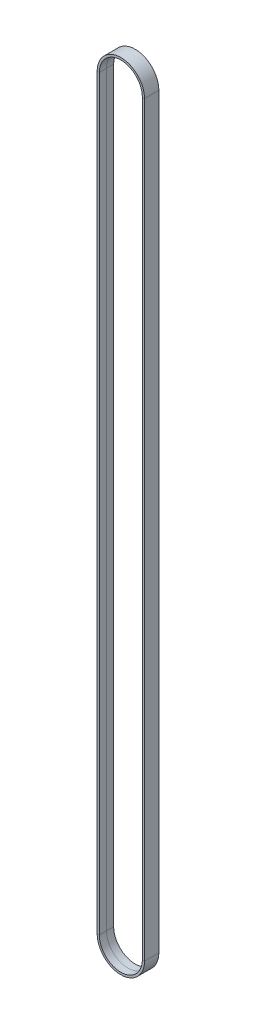
ISO-10303-21;
HEADER;
FILE_DESCRIPTION(('STEP AP214'),'2;1');
FILE_NAME('part.step','',(''),(''),'','','');
FILE_SCHEMA(('AUTOMOTIVE_DESIGN { 1 0 10303 214 1 1 1 1 }'));
ENDSEC;
DATA;
#1=APPLICATION_CONTEXT('core data for automotive mechanical design processes');
#2=APPLICATION_PROTOCOL_DEFINITION('international standard','automotive_design',2000,#1);
#3=PRODUCT_CONTEXT('',#1,'mechanical');
#4=PRODUCT('Part','Part','',(#3));
#5=PRODUCT_RELATED_PRODUCT_CATEGORY('part','',(#4));
#6=PRODUCT_DEFINITION_FORMATION('','',#4);
#7=PRODUCT_DEFINITION_CONTEXT('part definition',#1,'design');
#8=PRODUCT_DEFINITION('design','',#6,#7);
#9=PRODUCT_DEFINITION_SHAPE('','',#8);
#10=(LENGTH_UNIT() NAMED_UNIT(*) SI_UNIT(.MILLI.,.METRE.));
#11=(NAMED_UNIT(*) PLANE_ANGLE_UNIT() SI_UNIT($,.RADIAN.));
#12=(NAMED_UNIT(*) SI_UNIT($,.STERADIAN.) SOLID_ANGLE_UNIT());
#13=UNCERTAINTY_MEASURE_WITH_UNIT(LENGTH_MEASURE(1.E-05),#10,'distance_accuracy_value','');
#14=(GEOMETRIC_REPRESENTATION_CONTEXT(3) GLOBAL_UNCERTAINTY_ASSIGNED_CONTEXT((#13)) GLOBAL_UNIT_ASSIGNED_CONTEXT((#10,
#11,#12)) REPRESENTATION_CONTEXT('',''));
#15=CARTESIAN_POINT('',(0.,0.,0.));
#16=DIRECTION('',(0.,0.,1.));
#17=DIRECTION('',(1.,0.,0.));
#18=AXIS2_PLACEMENT_3D('',#15,#16,#17);
#19=CARTESIAN_POINT('',(-63.4535013190872,468.894202141089,4.5));
#20=DIRECTION('',(0.,0.,1.));
#21=DIRECTION('',(1.,0.,0.));
#22=AXIS2_PLACEMENT_3D('',#19,#20,#21);
#23=PLANE('',#22);
#24=DIRECTION('',(0.,-1.,0.));
#25=VECTOR('',#24,1.);
#26=CARTESIAN_POINT('',(-63.4535013190872,468.894202141089,4.5));
#27=LINE('',#26,#25);
#28=CARTESIAN_POINT('',(-63.4535013190872,468.89420214105,4.5));
#29=VERTEX_POINT('',#28);
#30=CARTESIAN_POINT('',(-63.4535013190872,1.1109907647129E-09,4.5));
#31=VERTEX_POINT('',#30);
#32=EDGE_CURVE('E11',#29,#31,#27,.T.);
#33=ORIENTED_EDGE('',*,*,#32,.F.);
#34=DIRECTION('',(-1.,0.,0.));
#35=VECTOR('',#34,1.);
#36=CARTESIAN_POINT('',(-63.4535013190872,468.89420214105,4.5));
#37=LINE('',#36,#35);
#38=CARTESIAN_POINT('',(-64.8135013190872,468.89420214105,4.5));
#39=VERTEX_POINT('',#38);
#40=EDGE_CURVE('E39',#29,#39,#37,.T.);
#41=ORIENTED_EDGE('',*,*,#40,.T.);
#42=DIRECTION('',(0.,-1.,0.));
#43=VECTOR('',#42,1.);
#44=CARTESIAN_POINT('',(-64.8135013190872,468.894202141089,4.5));
#45=LINE('',#44,#43);
#46=CARTESIAN_POINT('',(-64.8135013190872,1.1109907647129E-09,4.5));
#47=VERTEX_POINT('',#46);
#48=EDGE_CURVE('E152',#39,#47,#45,.T.);
#49=ORIENTED_EDGE('',*,*,#48,.T.);
#50=DIRECTION('',(-1.,0.,0.));
#51=VECTOR('',#50,1.);
#52=CARTESIAN_POINT('',(-63.4535013190872,1.1109907647129E-09,4.5));
#53=LINE('',#52,#51);
#54=EDGE_CURVE('E155',#31,#47,#53,.T.);
#55=ORIENTED_EDGE('',*,*,#54,.F.);
#56=EDGE_LOOP('',(#33,#41,#49,#55));
#57=FACE_BOUND('',#56,.T.);
#58=ADVANCED_FACE('F36',(#57),#23,.T.);
#59=CARTESIAN_POINT('',(-63.4535013190872,468.894202141089,-4.5));
#60=DIRECTION('',(1.,0.,0.));
#61=DIRECTION('',(0.,0.,-1.));
#62=AXIS2_PLACEMENT_3D('',#59,#60,#61);
#63=PLANE('',#62);
#64=DIRECTION('',(0.,-1.,0.));
#65=VECTOR('',#64,1.);
#66=CARTESIAN_POINT('',(-63.4535013190872,468.894202141089,-4.5));
#67=LINE('',#66,#65);
#68=CARTESIAN_POINT('',(-63.4535013190872,468.89420214105,-4.5));
#69=VERTEX_POINT('',#68);
#70=CARTESIAN_POINT('',(-63.4535013190872,1.1109907647129E-09,-4.5));
#71=VERTEX_POINT('',#70);
#72=EDGE_CURVE('E44',#69,#71,#67,.T.);
#73=ORIENTED_EDGE('',*,*,#72,.F.);
#74=DIRECTION('',(0.,0.,1.));
#75=VECTOR('',#74,1.);
#76=CARTESIAN_POINT('',(-63.4535013190872,468.89420214105,-4.5));
#77=LINE('',#76,#75);
#78=EDGE_CURVE('E235',#69,#29,#77,.T.);
#79=ORIENTED_EDGE('',*,*,#78,.T.);
#80=ORIENTED_EDGE('',*,*,#32,.T.);
#81=DIRECTION('',(0.,0.,1.));
#82=VECTOR('',#81,1.);
#83=CARTESIAN_POINT('',(-63.4535013190872,1.1109907647129E-09,-4.5));
#84=LINE('',#83,#82);
#85=EDGE_CURVE('E176',#71,#31,#84,.T.);
#86=ORIENTED_EDGE('',*,*,#85,.F.);
#87=EDGE_LOOP('',(#73,#79,#80,#86));
#88=FACE_BOUND('',#87,.T.);
#89=ADVANCED_FACE('F259',(#88),#63,.T.);
#90=CARTESIAN_POINT('',(-64.8135013190872,468.894202141089,-4.5));
#91=DIRECTION('',(0.,0.,-1.));
#92=DIRECTION('',(-1.,0.,0.));
#93=AXIS2_PLACEMENT_3D('',#90,#91,#92);
#94=PLANE('',#93);
#95=DIRECTION('',(0.,-1.,0.));
#96=VECTOR('',#95,1.);
#97=CARTESIAN_POINT('',(-64.8135013190872,468.894202141089,-4.5));
#98=LINE('',#97,#96);
#99=CARTESIAN_POINT('',(-64.8135013190872,468.89420214105,-4.5));
#100=VERTEX_POINT('',#99);
#101=CARTESIAN_POINT('',(-64.8135013190872,1.1109907647129E-09,-4.5));
#102=VERTEX_POINT('',#101);
#103=EDGE_CURVE('E141',#100,#102,#98,.T.);
#104=ORIENTED_EDGE('',*,*,#103,.F.);
#105=DIRECTION('',(1.,0.,0.));
#106=VECTOR('',#105,1.);
#107=CARTESIAN_POINT('',(-64.8135013190872,468.89420214105,-4.5));
#108=LINE('',#107,#106);
#109=EDGE_CURVE('E220',#100,#69,#108,.T.);
#110=ORIENTED_EDGE('',*,*,#109,.T.);
#111=ORIENTED_EDGE('',*,*,#72,.T.);
#112=DIRECTION('',(1.,0.,0.));
#113=VECTOR('',#112,1.);
#114=CARTESIAN_POINT('',(-64.8135013190872,1.1109907647129E-09,-4.5));
#115=LINE('',#114,#113);
#116=EDGE_CURVE('E182',#102,#71,#115,.T.);
#117=ORIENTED_EDGE('',*,*,#116,.F.);
#118=EDGE_LOOP('',(#104,#110,#111,#117));
#119=FACE_BOUND('',#118,.T.);
#120=ADVANCED_FACE('F264',(#119),#94,.T.);
#121=CARTESIAN_POINT('',(-64.8135013190872,468.894202141089,0.));
#122=DIRECTION('',(-1.,0.,0.));
#123=DIRECTION('',(0.,0.,1.));
#124=AXIS2_PLACEMENT_3D('',#121,#122,#123);
#125=PLANE('',#124);
#126=DIRECTION('',(0.,-1.,0.));
#127=VECTOR('',#126,1.);
#128=CARTESIAN_POINT('',(-64.8135013190872,468.894202141089,0.));
#129=LINE('',#128,#127);
#130=CARTESIAN_POINT('',(-64.8135013190872,468.89420214105,0.));
#131=VERTEX_POINT('',#130);
#132=CARTESIAN_POINT('',(-64.8135013190872,1.1109907647129E-09,0.));
#133=VERTEX_POINT('',#132);
#134=EDGE_CURVE('E148',#131,#133,#129,.T.);
#135=ORIENTED_EDGE('',*,*,#134,.F.);
#136=DIRECTION('',(0.,0.,-1.));
#137=VECTOR('',#136,1.);
#138=CARTESIAN_POINT('',(-64.8135013190872,468.89420214105,0.));
#139=LINE('',#138,#137);
#140=EDGE_CURVE('E204',#131,#100,#139,.T.);
#141=ORIENTED_EDGE('',*,*,#140,.T.);
#142=ORIENTED_EDGE('',*,*,#103,.T.);
#143=DIRECTION('',(0.,0.,-1.));
#144=VECTOR('',#143,1.);
#145=CARTESIAN_POINT('',(-64.8135013190872,1.1109907647129E-09,0.));
#146=LINE('',#145,#144);
#147=EDGE_CURVE('E179',#133,#102,#146,.T.);
#148=ORIENTED_EDGE('',*,*,#147,.F.);
#149=EDGE_LOOP('',(#135,#141,#142,#148));
#150=FACE_BOUND('',#149,.T.);
#151=ADVANCED_FACE('F267',(#150),#125,.T.);
#152=CARTESIAN_POINT('',(-93.1735013190872,468.89420213925,4.5));
#153=DIRECTION('',(0.,0.,1.));
#154=DIRECTION('',(1.,0.,0.));
#155=AXIS2_PLACEMENT_3D('',#152,#153,#154);
#156=PLANE('',#155);
#157=ORIENTED_EDGE('',*,*,#40,.F.);
#158=CARTESIAN_POINT('',(-78.3135013190872,468.89420214015,4.5));
#159=DIRECTION('',(0.,0.,-1.));
#160=DIRECTION('',(-1.,-6.05616947349362E-11,0.));
#161=AXIS2_PLACEMENT_3D('',#158,#159,#160);
#162=CIRCLE('',#161,14.86);
#163=CARTESIAN_POINT('',(-93.1735013190872,468.894202139249,4.5));
#164=VERTEX_POINT('',#163);
#165=EDGE_CURVE('E81',#164,#29,#162,.T.);
#166=ORIENTED_EDGE('',*,*,#165,.F.);
#167=DIRECTION('',(1.,5.99397968617669E-13,0.));
#168=VECTOR('',#167,1.);
#169=CARTESIAN_POINT('',(-93.1735013190872,468.894202139249,4.5));
#170=LINE('',#169,#168);
#171=CARTESIAN_POINT('',(-91.8135013190872,468.89420213925,4.5));
#172=VERTEX_POINT('',#171);
#173=EDGE_CURVE('E207',#164,#172,#170,.T.);
#174=ORIENTED_EDGE('',*,*,#173,.T.);
#175=CARTESIAN_POINT('',(-78.3135013190872,468.89420214015,4.5));
#176=DIRECTION('',(0.,0.,-1.));
#177=DIRECTION('',(-1.,-6.66627247230483E-11,0.));
#178=AXIS2_PLACEMENT_3D('',#175,#176,#177);
#179=CIRCLE('',#178,13.5);
#180=EDGE_CURVE('E201',#172,#39,#179,.T.);
#181=ORIENTED_EDGE('',*,*,#180,.T.);
#182=EDGE_LOOP('',(#157,#166,#174,#181));
#183=FACE_BOUND('',#182,.T.);
#184=ADVANCED_FACE('F248',(#183),#156,.T.);
#185=CARTESIAN_POINT('',(-78.3135013190872,468.89420214015,0.));
#186=DIRECTION('',(0.,0.,-1.));
#187=DIRECTION('',(-1.,0.,0.));
#188=AXIS2_PLACEMENT_3D('',#185,#186,#187);
#189=CYLINDRICAL_SURFACE('',#188,14.86);
#190=ORIENTED_EDGE('',*,*,#165,.T.);
#191=ORIENTED_EDGE('',*,*,#78,.F.);
#192=CARTESIAN_POINT('',(-78.3135013190872,468.89420214015,-4.5));
#193=DIRECTION('',(0.,0.,-1.));
#194=DIRECTION('',(-1.,-6.05616947349362E-11,0.));
#195=AXIS2_PLACEMENT_3D('',#192,#193,#194);
#196=CIRCLE('',#195,14.86);
#197=CARTESIAN_POINT('',(-93.1735013190872,468.894202139249,-4.5));
#198=VERTEX_POINT('',#197);
#199=EDGE_CURVE('E90',#198,#69,#196,.T.);
#200=ORIENTED_EDGE('',*,*,#199,.F.);
#201=DIRECTION('',(0.,0.,1.));
#202=VECTOR('',#201,1.);
#203=CARTESIAN_POINT('',(-93.1735013190872,468.894202139249,-4.5));
#204=LINE('',#203,#202);
#205=EDGE_CURVE('E231',#198,#164,#204,.T.);
#206=ORIENTED_EDGE('',*,*,#205,.T.);
#207=EDGE_LOOP('',(#190,#191,#200,#206));
#208=FACE_BOUND('',#207,.T.);
#209=ADVANCED_FACE('F258',(#208),#189,.T.);
#210=CARTESIAN_POINT('',(-91.8135013190872,468.89420213925,-4.5));
#211=DIRECTION('',(0.,0.,-1.));
#212=DIRECTION('',(-1.,0.,0.));
#213=AXIS2_PLACEMENT_3D('',#210,#211,#212);
#214=PLANE('',#213);
#215=ORIENTED_EDGE('',*,*,#199,.T.);
#216=ORIENTED_EDGE('',*,*,#109,.F.);
#217=CARTESIAN_POINT('',(-78.3135013190872,468.89420214015,-4.5));
#218=DIRECTION('',(0.,0.,-1.));
#219=DIRECTION('',(-1.,-6.66627247230483E-11,0.));
#220=AXIS2_PLACEMENT_3D('',#217,#218,#219);
#221=CIRCLE('',#220,13.5);
#222=CARTESIAN_POINT('',(-91.8135013190872,468.89420213925,-4.5));
#223=VERTEX_POINT('',#222);
#224=EDGE_CURVE('E99',#223,#100,#221,.T.);
#225=ORIENTED_EDGE('',*,*,#224,.F.);
#226=DIRECTION('',(-1.,-5.99397968617669E-13,0.));
#227=VECTOR('',#226,1.);
#228=CARTESIAN_POINT('',(-91.8135013190872,468.89420213925,-4.5));
#229=LINE('',#228,#227);
#230=EDGE_CURVE('E217',#223,#198,#229,.T.);
#231=ORIENTED_EDGE('',*,*,#230,.T.);
#232=EDGE_LOOP('',(#215,#216,#225,#231));
#233=FACE_BOUND('',#232,.T.);
#234=ADVANCED_FACE('F279',(#233),#214,.T.);
#235=CARTESIAN_POINT('',(-78.3135013190872,468.89420214015,0.));
#236=DIRECTION('',(0.,0.,-1.));
#237=DIRECTION('',(-1.,0.,0.));
#238=AXIS2_PLACEMENT_3D('',#235,#236,#237);
#239=CYLINDRICAL_SURFACE('',#238,13.5);
#240=ORIENTED_EDGE('',*,*,#224,.T.);
#241=ORIENTED_EDGE('',*,*,#140,.F.);
#242=CARTESIAN_POINT('',(-78.3135013190872,468.89420214015,0.));
#243=DIRECTION('',(0.,0.,-1.));
#244=DIRECTION('',(-1.,-6.66627247230483E-11,0.));
#245=AXIS2_PLACEMENT_3D('',#242,#243,#244);
#246=CIRCLE('',#245,13.5);
#247=CARTESIAN_POINT('',(-91.8135013190872,468.89420213925,0.));
#248=VERTEX_POINT('',#247);
#249=EDGE_CURVE('E200',#248,#131,#246,.T.);
#250=ORIENTED_EDGE('',*,*,#249,.F.);
#251=DIRECTION('',(0.,0.,-1.));
#252=VECTOR('',#251,1.);
#253=CARTESIAN_POINT('',(-91.8135013190872,468.89420213925,0.));
#254=LINE('',#253,#252);
#255=EDGE_CURVE('E194',#248,#223,#254,.T.);
#256=ORIENTED_EDGE('',*,*,#255,.T.);
#257=EDGE_LOOP('',(#240,#241,#250,#256));
#258=FACE_BOUND('',#257,.T.);
#259=ADVANCED_FACE('F270',(#258),#239,.F.);
#260=CARTESIAN_POINT('',(-78.3135013190872,468.89420214015,0.));
#261=DIRECTION('',(0.,0.,-1.));
#262=DIRECTION('',(-1.,0.,0.));
#263=AXIS2_PLACEMENT_3D('',#260,#261,#262);
#264=CYLINDRICAL_SURFACE('',#263,13.5);
#265=ORIENTED_EDGE('',*,*,#249,.T.);
#266=DIRECTION('',(0.,0.,-1.));
#267=VECTOR('',#266,1.);
#268=CARTESIAN_POINT('',(-64.8135013190872,468.89420214105,4.5));
#269=LINE('',#268,#267);
#270=EDGE_CURVE('E198',#39,#131,#269,.T.);
#271=ORIENTED_EDGE('',*,*,#270,.F.);
#272=ORIENTED_EDGE('',*,*,#180,.F.);
#273=DIRECTION('',(0.,0.,-1.));
#274=VECTOR('',#273,1.);
#275=CARTESIAN_POINT('',(-91.8135013190872,468.89420213925,4.5));
#276=LINE('',#275,#274);
#277=EDGE_CURVE('E189',#172,#248,#276,.T.);
#278=ORIENTED_EDGE('',*,*,#277,.T.);
#279=EDGE_LOOP('',(#265,#271,#272,#278));
#280=FACE_BOUND('',#279,.T.);
#281=ADVANCED_FACE('F271',(#280),#264,.F.);
#282=CARTESIAN_POINT('',(-93.1735013190872,-6.89695992196448E-10,4.5));
#283=DIRECTION('',(0.,0.,1.));
#284=DIRECTION('',(1.,0.,0.));
#285=AXIS2_PLACEMENT_3D('',#282,#283,#284);
#286=PLANE('',#285);
#287=ORIENTED_EDGE('',*,*,#173,.F.);
#288=DIRECTION('',(0.,1.,0.));
#289=VECTOR('',#288,1.);
#290=CARTESIAN_POINT('',(-93.1735013190872,-6.89695992196448E-10,4.5));
#291=LINE('',#290,#289);
#292=CARTESIAN_POINT('',(-93.1735013190872,-6.97788065048704E-10,4.5));
#293=VERTEX_POINT('',#292);
#294=EDGE_CURVE('E241',#293,#164,#291,.T.);
#295=ORIENTED_EDGE('',*,*,#294,.F.);
#296=DIRECTION('',(1.,5.99397968617669E-13,0.));
#297=VECTOR('',#296,1.);
#298=CARTESIAN_POINT('',(-93.1735013190872,-6.97791024564075E-10,4.5));
#299=LINE('',#298,#297);
#300=CARTESIAN_POINT('',(-91.8135013190872,-6.9697315466878E-10,4.5));
#301=VERTEX_POINT('',#300);
#302=EDGE_CURVE('E197',#293,#301,#299,.T.);
#303=ORIENTED_EDGE('',*,*,#302,.T.);
#304=DIRECTION('',(0.,1.,0.));
#305=VECTOR('',#304,1.);
#306=CARTESIAN_POINT('',(-91.8135013190872,-6.88880810959128E-10,4.5));
#307=LINE('',#306,#305);
#308=EDGE_CURVE('E192',#301,#172,#307,.T.);
#309=ORIENTED_EDGE('',*,*,#308,.T.);
#310=EDGE_LOOP('',(#287,#295,#303,#309));
#311=FACE_BOUND('',#310,.T.);
#312=ADVANCED_FACE('F253',(#311),#286,.T.);
#313=CARTESIAN_POINT('',(-93.1735013190872,-6.89695992196448E-10,-4.5));
#314=DIRECTION('',(-1.,0.,0.));
#315=DIRECTION('',(0.,0.,1.));
#316=AXIS2_PLACEMENT_3D('',#313,#314,#315);
#317=PLANE('',#316);
#318=ORIENTED_EDGE('',*,*,#294,.T.);
#319=ORIENTED_EDGE('',*,*,#205,.F.);
#320=DIRECTION('',(0.,1.,0.));
#321=VECTOR('',#320,1.);
#322=CARTESIAN_POINT('',(-93.1735013190872,-6.89695992196448E-10,-4.5));
#323=LINE('',#322,#321);
#324=CARTESIAN_POINT('',(-93.1735013190872,-6.97788065048704E-10,-4.5));
#325=VERTEX_POINT('',#324);
#326=EDGE_CURVE('E112',#325,#198,#323,.T.);
#327=ORIENTED_EDGE('',*,*,#326,.F.);
#328=DIRECTION('',(0.,0.,1.));
#329=VECTOR('',#328,1.);
#330=CARTESIAN_POINT('',(-93.1735013190872,-6.97791024564075E-10,-4.5));
#331=LINE('',#330,#329);
#332=EDGE_CURVE('E228',#325,#293,#331,.T.);
#333=ORIENTED_EDGE('',*,*,#332,.T.);
#334=EDGE_LOOP('',(#318,#319,#327,#333));
#335=FACE_BOUND('',#334,.T.);
#336=ADVANCED_FACE('F257',(#335),#317,.T.);
#337=CARTESIAN_POINT('',(-91.8135013190872,-6.88880810959128E-10,-4.5));
#338=DIRECTION('',(0.,0.,-1.));
#339=DIRECTION('',(-1.,0.,0.));
#340=AXIS2_PLACEMENT_3D('',#337,#338,#339);
#341=PLANE('',#340);
#342=ORIENTED_EDGE('',*,*,#326,.T.);
#343=ORIENTED_EDGE('',*,*,#230,.F.);
#344=DIRECTION('',(0.,1.,0.));
#345=VECTOR('',#344,1.);
#346=CARTESIAN_POINT('',(-91.8135013190872,-6.88880810959128E-10,-4.5));
#347=LINE('',#346,#345);
#348=CARTESIAN_POINT('',(-91.8135013190872,-6.9697315466878E-10,-4.5));
#349=VERTEX_POINT('',#348);
#350=EDGE_CURVE('E119',#349,#223,#347,.T.);
#351=ORIENTED_EDGE('',*,*,#350,.F.);
#352=DIRECTION('',(-1.,-5.99397968617669E-13,0.));
#353=VECTOR('',#352,1.);
#354=CARTESIAN_POINT('',(-91.8135013190872,-6.96975843326755E-10,-4.5));
#355=LINE('',#354,#353);
#356=EDGE_CURVE('E213',#349,#325,#355,.T.);
#357=ORIENTED_EDGE('',*,*,#356,.T.);
#358=EDGE_LOOP('',(#342,#343,#351,#357));
#359=FACE_BOUND('',#358,.T.);
#360=ADVANCED_FACE('F308',(#359),#341,.T.);
#361=CARTESIAN_POINT('',(-91.8135013190872,-6.88880810959128E-10,0.));
#362=DIRECTION('',(1.,0.,0.));
#363=DIRECTION('',(0.,0.,-1.));
#364=AXIS2_PLACEMENT_3D('',#361,#362,#363);
#365=PLANE('',#364);
#366=ORIENTED_EDGE('',*,*,#350,.T.);
#367=ORIENTED_EDGE('',*,*,#255,.F.);
#368=DIRECTION('',(0.,1.,0.));
#369=VECTOR('',#368,1.);
#370=CARTESIAN_POINT('',(-91.8135013190872,-6.88880810959128E-10,0.));
#371=LINE('',#370,#369);
#372=CARTESIAN_POINT('',(-91.8135013190872,-6.9697315466878E-10,0.));
#373=VERTEX_POINT('',#372);
#374=EDGE_CURVE('E127',#373,#248,#371,.T.);
#375=ORIENTED_EDGE('',*,*,#374,.F.);
#376=DIRECTION('',(0.,0.,-1.));
#377=VECTOR('',#376,1.);
#378=CARTESIAN_POINT('',(-91.8135013190872,-6.96975843326755E-10,0.));
#379=LINE('',#378,#377);
#380=EDGE_CURVE('E187',#373,#349,#379,.T.);
#381=ORIENTED_EDGE('',*,*,#380,.T.);
#382=EDGE_LOOP('',(#366,#367,#375,#381));
#383=FACE_BOUND('',#382,.T.);
#384=ADVANCED_FACE('F311',(#383),#365,.T.);
#385=CARTESIAN_POINT('',(-91.8135013190872,-6.88880810959128E-10,4.5));
#386=DIRECTION('',(1.,0.,0.));
#387=DIRECTION('',(0.,0.,-1.));
#388=AXIS2_PLACEMENT_3D('',#385,#386,#387);
#389=PLANE('',#388);
#390=ORIENTED_EDGE('',*,*,#374,.T.);
#391=ORIENTED_EDGE('',*,*,#277,.F.);
#392=ORIENTED_EDGE('',*,*,#308,.F.);
#393=DIRECTION('',(0.,0.,-1.));
#394=VECTOR('',#393,1.);
#395=CARTESIAN_POINT('',(-91.8135013190872,-6.96975843326755E-10,4.5));
#396=LINE('',#395,#394);
#397=EDGE_CURVE('E168',#301,#373,#396,.T.);
#398=ORIENTED_EDGE('',*,*,#397,.T.);
#399=EDGE_LOOP('',(#390,#391,#392,#398));
#400=FACE_BOUND('',#399,.T.);
#401=ADVANCED_FACE('F251',(#400),#389,.T.);
#402=CARTESIAN_POINT('',(-63.4535013190872,1.1109907647129E-09,4.5));
#403=DIRECTION('',(0.,0.,1.));
#404=DIRECTION('',(1.,0.,0.));
#405=AXIS2_PLACEMENT_3D('',#402,#403,#404);
#406=PLANE('',#405);
#407=ORIENTED_EDGE('',*,*,#302,.F.);
#408=CARTESIAN_POINT('',(-78.3135013190872,2.11053396981242E-10,4.5));
#409=DIRECTION('',(0.,0.,-1.));
#410=DIRECTION('',(1.,6.0561061085576E-11,0.));
#411=AXIS2_PLACEMENT_3D('',#408,#409,#410);
#412=CIRCLE('',#411,14.86);
#413=EDGE_CURVE('E175',#31,#293,#412,.T.);
#414=ORIENTED_EDGE('',*,*,#413,.F.);
#415=ORIENTED_EDGE('',*,*,#54,.T.);
#416=CARTESIAN_POINT('',(-78.3135013190872,2.11053396981242E-10,4.5));
#417=DIRECTION('',(0.,0.,-1.));
#418=DIRECTION('',(1.,6.66620272393822E-11,0.));
#419=AXIS2_PLACEMENT_3D('',#416,#417,#418);
#420=CIRCLE('',#419,13.5);
#421=EDGE_CURVE('E163',#47,#301,#420,.T.);
#422=ORIENTED_EDGE('',*,*,#421,.T.);
#423=EDGE_LOOP('',(#407,#414,#415,#422));
#424=FACE_BOUND('',#423,.T.);
#425=ADVANCED_FACE('F173',(#424),#406,.T.);
#426=CARTESIAN_POINT('',(-78.3135013190872,2.11053396981242E-10,0.));
#427=DIRECTION('',(0.,0.,-1.));
#428=DIRECTION('',(-1.,0.,0.));
#429=AXIS2_PLACEMENT_3D('',#426,#427,#428);
#430=CYLINDRICAL_SURFACE('',#429,14.86);
#431=ORIENTED_EDGE('',*,*,#413,.T.);
#432=ORIENTED_EDGE('',*,*,#332,.F.);
#433=CARTESIAN_POINT('',(-78.3135013190872,2.11053396981242E-10,-4.5));
#434=DIRECTION('',(0.,0.,-1.));
#435=DIRECTION('',(1.,6.0561061085576E-11,0.));
#436=AXIS2_PLACEMENT_3D('',#433,#434,#435);
#437=CIRCLE('',#436,14.86);
#438=EDGE_CURVE('E225',#71,#325,#437,.T.);
#439=ORIENTED_EDGE('',*,*,#438,.F.);
#440=ORIENTED_EDGE('',*,*,#85,.T.);
#441=EDGE_LOOP('',(#431,#432,#439,#440));
#442=FACE_BOUND('',#441,.T.);
#443=ADVANCED_FACE('F255',(#442),#430,.T.);
#444=CARTESIAN_POINT('',(-64.8135013190872,1.1109907647129E-09,-4.5));
#445=DIRECTION('',(0.,0.,-1.));
#446=DIRECTION('',(-1.,0.,0.));
#447=AXIS2_PLACEMENT_3D('',#444,#445,#446);
#448=PLANE('',#447);
#449=ORIENTED_EDGE('',*,*,#438,.T.);
#450=ORIENTED_EDGE('',*,*,#356,.F.);
#451=CARTESIAN_POINT('',(-78.3135013190872,2.11053396981242E-10,-4.5));
#452=DIRECTION('',(0.,0.,-1.));
#453=DIRECTION('',(1.,6.66620272393822E-11,0.));
#454=AXIS2_PLACEMENT_3D('',#451,#452,#453);
#455=CIRCLE('',#454,13.5);
#456=EDGE_CURVE('E210',#102,#349,#455,.T.);
#457=ORIENTED_EDGE('',*,*,#456,.F.);
#458=ORIENTED_EDGE('',*,*,#116,.T.);
#459=EDGE_LOOP('',(#449,#450,#457,#458));
#460=FACE_BOUND('',#459,.T.);
#461=ADVANCED_FACE('F262',(#460),#448,.T.);
#462=CARTESIAN_POINT('',(-78.3135013190872,2.11053396981242E-10,0.));
#463=DIRECTION('',(0.,0.,-1.));
#464=DIRECTION('',(-1.,0.,0.));
#465=AXIS2_PLACEMENT_3D('',#462,#463,#464);
#466=CYLINDRICAL_SURFACE('',#465,13.5);
#467=ORIENTED_EDGE('',*,*,#456,.T.);
#468=ORIENTED_EDGE('',*,*,#380,.F.);
#469=CARTESIAN_POINT('',(-78.3135013190872,2.11053396981242E-10,0.));
#470=DIRECTION('',(0.,0.,-1.));
#471=DIRECTION('',(1.,6.66620272393822E-11,0.));
#472=AXIS2_PLACEMENT_3D('',#469,#470,#471);
#473=CIRCLE('',#472,13.5);
#474=EDGE_CURVE('E186',#133,#373,#473,.T.);
#475=ORIENTED_EDGE('',*,*,#474,.F.);
#476=ORIENTED_EDGE('',*,*,#147,.T.);
#477=EDGE_LOOP('',(#467,#468,#475,#476));
#478=FACE_BOUND('',#477,.T.);
#479=ADVANCED_FACE('F266',(#478),#466,.F.);
#480=CARTESIAN_POINT('',(-78.3135013190872,2.11053396981242E-10,0.));
#481=DIRECTION('',(0.,0.,-1.));
#482=DIRECTION('',(-1.,0.,0.));
#483=AXIS2_PLACEMENT_3D('',#480,#481,#482);
#484=CYLINDRICAL_SURFACE('',#483,13.5);
#485=ORIENTED_EDGE('',*,*,#474,.T.);
#486=ORIENTED_EDGE('',*,*,#397,.F.);
#487=ORIENTED_EDGE('',*,*,#421,.F.);
#488=DIRECTION('',(0.,0.,-1.));
#489=VECTOR('',#488,1.);
#490=CARTESIAN_POINT('',(-64.8135013190872,1.1109907647129E-09,4.5));
#491=LINE('',#490,#489);
#492=EDGE_CURVE('E166',#47,#133,#491,.T.);
#493=ORIENTED_EDGE('',*,*,#492,.T.);
#494=EDGE_LOOP('',(#485,#486,#487,#493));
#495=FACE_BOUND('',#494,.T.);
#496=ADVANCED_FACE('F165',(#495),#484,.F.);
#497=CARTESIAN_POINT('',(-64.8135013190872,468.894202141089,4.5));
#498=DIRECTION('',(-1.,0.,0.));
#499=DIRECTION('',(0.,0.,1.));
#500=AXIS2_PLACEMENT_3D('',#497,#498,#499);
#501=PLANE('',#500);
#502=ORIENTED_EDGE('',*,*,#270,.T.);
#503=ORIENTED_EDGE('',*,*,#134,.T.);
#504=ORIENTED_EDGE('',*,*,#492,.F.);
#505=ORIENTED_EDGE('',*,*,#48,.F.);
#506=EDGE_LOOP('',(#502,#503,#504,#505));
#507=FACE_BOUND('',#506,.T.);
#508=ADVANCED_FACE('F178',(#507),#501,.T.);
#509=CLOSED_SHELL('',(#58,#89,#120,#151,#184,#209,#234,#259,#281,#312,#336,#360,#384,#401,#425,
#443,#461,#479,#496,#508));
#510=MANIFOLD_SOLID_BREP('B2',#509);
#511=ADVANCED_BREP_SHAPE_REPRESENTATION('',(#18,#510),#14);
#512=SHAPE_DEFINITION_REPRESENTATION(#9,#511);
ENDSEC;
END-ISO-10303-21;
